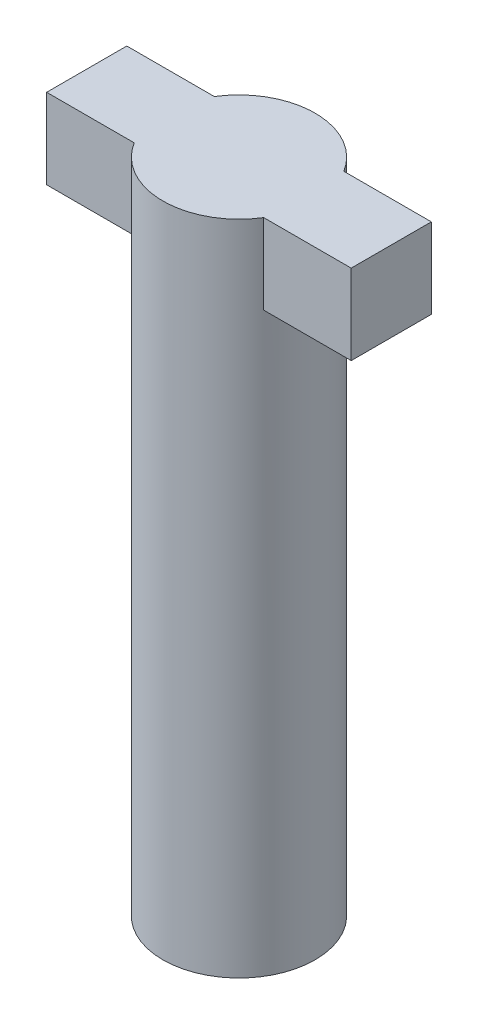
ISO-10303-21;
HEADER;
FILE_DESCRIPTION(('STEP AP214'),'2;1');
FILE_NAME('part.step','',(''),(''),'','','');
FILE_SCHEMA(('AUTOMOTIVE_DESIGN { 1 0 10303 214 1 1 1 1 }'));
ENDSEC;
DATA;
#1=APPLICATION_CONTEXT('core data for automotive mechanical design processes');
#2=APPLICATION_PROTOCOL_DEFINITION('international standard','automotive_design',2000,#1);
#3=PRODUCT_CONTEXT('',#1,'mechanical');
#4=PRODUCT('Part','Part','',(#3));
#5=PRODUCT_RELATED_PRODUCT_CATEGORY('part','',(#4));
#6=PRODUCT_DEFINITION_FORMATION('','',#4);
#7=PRODUCT_DEFINITION_CONTEXT('part definition',#1,'design');
#8=PRODUCT_DEFINITION('design','',#6,#7);
#9=PRODUCT_DEFINITION_SHAPE('','',#8);
#10=(LENGTH_UNIT() NAMED_UNIT(*) SI_UNIT(.MILLI.,.METRE.));
#11=(NAMED_UNIT(*) PLANE_ANGLE_UNIT() SI_UNIT($,.RADIAN.));
#12=(NAMED_UNIT(*) SI_UNIT($,.STERADIAN.) SOLID_ANGLE_UNIT());
#13=UNCERTAINTY_MEASURE_WITH_UNIT(LENGTH_MEASURE(1.E-05),#10,'distance_accuracy_value','');
#14=(GEOMETRIC_REPRESENTATION_CONTEXT(3) GLOBAL_UNCERTAINTY_ASSIGNED_CONTEXT((#13)) GLOBAL_UNIT_ASSIGNED_CONTEXT((#10,
#11,#12)) REPRESENTATION_CONTEXT('',''));
#15=CARTESIAN_POINT('',(0.,0.,0.));
#16=DIRECTION('',(0.,0.,1.));
#17=DIRECTION('',(1.,0.,0.));
#18=AXIS2_PLACEMENT_3D('',#15,#16,#17);
#19=CARTESIAN_POINT('',(0.,8.2,0.));
#20=DIRECTION('',(0.,-1.,0.));
#21=DIRECTION('',(0.,0.,-1.));
#22=AXIS2_PLACEMENT_3D('',#19,#20,#21);
#23=CYLINDRICAL_SURFACE('',#22,0.95);
#24=CARTESIAN_POINT('',(0.,7.2,0.));
#25=DIRECTION('',(0.,1.,0.));
#26=DIRECTION('',(0.,0.,1.));
#27=AXIS2_PLACEMENT_3D('',#24,#25,#26);
#28=CIRCLE('',#27,0.95);
#29=CARTESIAN_POINT('',(-0.807774721070176,7.2,-0.5));
#30=VERTEX_POINT('',#29);
#31=CARTESIAN_POINT('',(-0.807774721070176,7.2,0.5));
#32=VERTEX_POINT('',#31);
#33=EDGE_CURVE('E124',#30,#32,#28,.T.);
#34=ORIENTED_EDGE('',*,*,#33,.F.);
#35=DIRECTION('',(0.,1.,0.));
#36=VECTOR('',#35,1.);
#37=CARTESIAN_POINT('',(-0.807774721070176,7.2,-0.5));
#38=LINE('',#37,#36);
#39=CARTESIAN_POINT('',(-0.807774721070176,8.2,-0.5));
#40=VERTEX_POINT('',#39);
#41=EDGE_CURVE('E138',#30,#40,#38,.T.);
#42=ORIENTED_EDGE('',*,*,#41,.T.);
#43=CARTESIAN_POINT('',(0.,8.2,0.));
#44=DIRECTION('',(0.,1.,0.));
#45=DIRECTION('',(0.,0.,1.));
#46=AXIS2_PLACEMENT_3D('',#43,#44,#45);
#47=CIRCLE('',#46,0.95);
#48=CARTESIAN_POINT('',(0.807774721070176,8.2,-0.5));
#49=VERTEX_POINT('',#48);
#50=EDGE_CURVE('E11',#49,#40,#47,.T.);
#51=ORIENTED_EDGE('',*,*,#50,.F.);
#52=DIRECTION('',(0.,1.,0.));
#53=VECTOR('',#52,1.);
#54=CARTESIAN_POINT('',(0.807774721070176,7.2,-0.5));
#55=LINE('',#54,#53);
#56=CARTESIAN_POINT('',(0.807774721070176,7.2,-0.5));
#57=VERTEX_POINT('',#56);
#58=EDGE_CURVE('E176',#57,#49,#55,.T.);
#59=ORIENTED_EDGE('',*,*,#58,.F.);
#60=CARTESIAN_POINT('',(0.,7.2,0.));
#61=DIRECTION('',(0.,1.,0.));
#62=DIRECTION('',(0.,0.,1.));
#63=AXIS2_PLACEMENT_3D('',#60,#61,#62);
#64=CIRCLE('',#63,0.95);
#65=CARTESIAN_POINT('',(0.807774721070176,7.2,0.5));
#66=VERTEX_POINT('',#65);
#67=EDGE_CURVE('E165',#66,#57,#64,.T.);
#68=ORIENTED_EDGE('',*,*,#67,.F.);
#69=DIRECTION('',(0.,1.,0.));
#70=VECTOR('',#69,1.);
#71=CARTESIAN_POINT('',(0.807774721070176,7.2,0.5));
#72=LINE('',#71,#70);
#73=CARTESIAN_POINT('',(0.807774721070176,8.2,0.5));
#74=VERTEX_POINT('',#73);
#75=EDGE_CURVE('E192',#66,#74,#72,.T.);
#76=ORIENTED_EDGE('',*,*,#75,.T.);
#77=CARTESIAN_POINT('',(-0.807774721070176,8.2,0.5));
#78=VERTEX_POINT('',#77);
#79=EDGE_CURVE('E56',#78,#74,#47,.T.);
#80=ORIENTED_EDGE('',*,*,#79,.F.);
#81=DIRECTION('',(0.,1.,0.));
#82=VECTOR('',#81,1.);
#83=CARTESIAN_POINT('',(-0.807774721070176,7.2,0.5));
#84=LINE('',#83,#82);
#85=EDGE_CURVE('E156',#32,#78,#84,.T.);
#86=ORIENTED_EDGE('',*,*,#85,.F.);
#87=EDGE_LOOP('',(#34,#42,#51,#59,#68,#76,#80,#86));
#88=FACE_BOUND('',#87,.T.);
#89=CARTESIAN_POINT('',(0.,0.,0.));
#90=DIRECTION('',(0.,1.,0.));
#91=DIRECTION('',(0.,0.,1.));
#92=AXIS2_PLACEMENT_3D('',#89,#90,#91);
#93=CIRCLE('',#92,0.95);
#94=CARTESIAN_POINT('',(0.,0.,0.95));
#95=VERTEX_POINT('',#94);
#96=EDGE_CURVE('E50',#95,#95,#93,.T.);
#97=ORIENTED_EDGE('',*,*,#96,.T.);
#98=EDGE_LOOP('',(#97));
#99=FACE_BOUND('',#98,.T.);
#100=ADVANCED_FACE('F47',(#88,#99),#23,.T.);
#101=CARTESIAN_POINT('',(0.,8.2,0.));
#102=DIRECTION('',(0.,1.,0.));
#103=DIRECTION('',(0.,0.,1.));
#104=AXIS2_PLACEMENT_3D('',#101,#102,#103);
#105=PLANE('',#104);
#106=ORIENTED_EDGE('',*,*,#79,.T.);
#107=DIRECTION('',(1.,0.,0.));
#108=VECTOR('',#107,1.);
#109=CARTESIAN_POINT('',(0.,8.2,0.5));
#110=LINE('',#109,#108);
#111=CARTESIAN_POINT('',(1.9,8.2,0.5));
#112=VERTEX_POINT('',#111);
#113=EDGE_CURVE('E179',#74,#112,#110,.T.);
#114=ORIENTED_EDGE('',*,*,#113,.T.);
#115=DIRECTION('',(0.,0.,1.));
#116=VECTOR('',#115,1.);
#117=CARTESIAN_POINT('',(1.9,8.2,0.));
#118=LINE('',#117,#116);
#119=CARTESIAN_POINT('',(1.9,8.2,-0.5));
#120=VERTEX_POINT('',#119);
#121=EDGE_CURVE('E166',#120,#112,#118,.T.);
#122=ORIENTED_EDGE('',*,*,#121,.F.);
#123=DIRECTION('',(1.,0.,0.));
#124=VECTOR('',#123,1.);
#125=CARTESIAN_POINT('',(0.,8.2,-0.5));
#126=LINE('',#125,#124);
#127=EDGE_CURVE('E69',#49,#120,#126,.T.);
#128=ORIENTED_EDGE('',*,*,#127,.F.);
#129=ORIENTED_EDGE('',*,*,#50,.T.);
#130=DIRECTION('',(-1.,0.,0.));
#131=VECTOR('',#130,1.);
#132=CARTESIAN_POINT('',(0.,8.2,-0.5));
#133=LINE('',#132,#131);
#134=CARTESIAN_POINT('',(-1.9,8.2,-0.5));
#135=VERTEX_POINT('',#134);
#136=EDGE_CURVE('E148',#40,#135,#133,.T.);
#137=ORIENTED_EDGE('',*,*,#136,.T.);
#138=DIRECTION('',(0.,0.,1.));
#139=VECTOR('',#138,1.);
#140=CARTESIAN_POINT('',(-1.9,8.2,0.));
#141=LINE('',#140,#139);
#142=CARTESIAN_POINT('',(-1.9,8.2,0.5));
#143=VERTEX_POINT('',#142);
#144=EDGE_CURVE('E118',#135,#143,#141,.T.);
#145=ORIENTED_EDGE('',*,*,#144,.T.);
#146=DIRECTION('',(-1.,0.,0.));
#147=VECTOR('',#146,1.);
#148=CARTESIAN_POINT('',(0.,8.2,0.5));
#149=LINE('',#148,#147);
#150=EDGE_CURVE('E63',#78,#143,#149,.T.);
#151=ORIENTED_EDGE('',*,*,#150,.F.);
#152=EDGE_LOOP('',(#106,#114,#122,#128,#129,#137,#145,#151));
#153=FACE_BOUND('',#152,.T.);
#154=ADVANCED_FACE('F207',(#153),#105,.T.);
#155=CARTESIAN_POINT('',(0.,0.,0.));
#156=DIRECTION('',(0.,1.,0.));
#157=DIRECTION('',(0.,0.,1.));
#158=AXIS2_PLACEMENT_3D('',#155,#156,#157);
#159=PLANE('',#158);
#160=ORIENTED_EDGE('',*,*,#96,.F.);
#161=EDGE_LOOP('',(#160));
#162=FACE_BOUND('',#161,.T.);
#163=ADVANCED_FACE('F204',(#162),#159,.F.);
#164=CARTESIAN_POINT('',(0.,7.2,-0.5));
#165=DIRECTION('',(0.,0.,1.));
#166=DIRECTION('',(1.,0.,0.));
#167=AXIS2_PLACEMENT_3D('',#164,#165,#166);
#168=PLANE('',#167);
#169=ORIENTED_EDGE('',*,*,#127,.T.);
#170=DIRECTION('',(0.,1.,0.));
#171=VECTOR('',#170,1.);
#172=CARTESIAN_POINT('',(1.9,7.2,-0.5));
#173=LINE('',#172,#171);
#174=CARTESIAN_POINT('',(1.9,7.2,-0.5));
#175=VERTEX_POINT('',#174);
#176=EDGE_CURVE('E151',#175,#120,#173,.T.);
#177=ORIENTED_EDGE('',*,*,#176,.F.);
#178=DIRECTION('',(1.,0.,0.));
#179=VECTOR('',#178,1.);
#180=CARTESIAN_POINT('',(0.,7.2,-0.5));
#181=LINE('',#180,#179);
#182=EDGE_CURVE('E161',#57,#175,#181,.T.);
#183=ORIENTED_EDGE('',*,*,#182,.F.);
#184=ORIENTED_EDGE('',*,*,#58,.T.);
#185=EDGE_LOOP('',(#169,#177,#183,#184));
#186=FACE_BOUND('',#185,.T.);
#187=ADVANCED_FACE('F206',(#186),#168,.F.);
#188=CARTESIAN_POINT('',(1.9,7.2,0.));
#189=DIRECTION('',(-1.,0.,0.));
#190=DIRECTION('',(0.,0.,1.));
#191=AXIS2_PLACEMENT_3D('',#188,#189,#190);
#192=PLANE('',#191);
#193=ORIENTED_EDGE('',*,*,#121,.T.);
#194=DIRECTION('',(0.,1.,0.));
#195=VECTOR('',#194,1.);
#196=CARTESIAN_POINT('',(1.9,7.2,0.5));
#197=LINE('',#196,#195);
#198=CARTESIAN_POINT('',(1.9,7.2,0.5));
#199=VERTEX_POINT('',#198);
#200=EDGE_CURVE('E189',#199,#112,#197,.T.);
#201=ORIENTED_EDGE('',*,*,#200,.F.);
#202=DIRECTION('',(0.,0.,1.));
#203=VECTOR('',#202,1.);
#204=CARTESIAN_POINT('',(1.9,7.2,0.));
#205=LINE('',#204,#203);
#206=EDGE_CURVE('E173',#175,#199,#205,.T.);
#207=ORIENTED_EDGE('',*,*,#206,.F.);
#208=ORIENTED_EDGE('',*,*,#176,.T.);
#209=EDGE_LOOP('',(#193,#201,#207,#208));
#210=FACE_BOUND('',#209,.T.);
#211=ADVANCED_FACE('F212',(#210),#192,.F.);
#212=CARTESIAN_POINT('',(0.,7.2,0.5));
#213=DIRECTION('',(0.,0.,1.));
#214=DIRECTION('',(1.,0.,0.));
#215=AXIS2_PLACEMENT_3D('',#212,#213,#214);
#216=PLANE('',#215);
#217=ORIENTED_EDGE('',*,*,#113,.F.);
#218=ORIENTED_EDGE('',*,*,#75,.F.);
#219=DIRECTION('',(1.,0.,0.));
#220=VECTOR('',#219,1.);
#221=CARTESIAN_POINT('',(0.,7.2,0.5));
#222=LINE('',#221,#220);
#223=EDGE_CURVE('E169',#66,#199,#222,.T.);
#224=ORIENTED_EDGE('',*,*,#223,.T.);
#225=ORIENTED_EDGE('',*,*,#200,.T.);
#226=EDGE_LOOP('',(#217,#218,#224,#225));
#227=FACE_BOUND('',#226,.T.);
#228=ADVANCED_FACE('F233',(#227),#216,.T.);
#229=CARTESIAN_POINT('',(0.,7.2,0.));
#230=DIRECTION('',(0.,1.,0.));
#231=DIRECTION('',(0.,0.,1.));
#232=AXIS2_PLACEMENT_3D('',#229,#230,#231);
#233=PLANE('',#232);
#234=ORIENTED_EDGE('',*,*,#182,.T.);
#235=ORIENTED_EDGE('',*,*,#206,.T.);
#236=ORIENTED_EDGE('',*,*,#223,.F.);
#237=ORIENTED_EDGE('',*,*,#67,.T.);
#238=EDGE_LOOP('',(#234,#235,#236,#237));
#239=FACE_BOUND('',#238,.T.);
#240=ADVANCED_FACE('F229',(#239),#233,.F.);
#241=CARTESIAN_POINT('',(0.,7.2,-0.5));
#242=DIRECTION('',(0.,0.,-1.));
#243=DIRECTION('',(-1.,0.,0.));
#244=AXIS2_PLACEMENT_3D('',#241,#242,#243);
#245=PLANE('',#244);
#246=ORIENTED_EDGE('',*,*,#136,.F.);
#247=ORIENTED_EDGE('',*,*,#41,.F.);
#248=DIRECTION('',(-1.,0.,0.));
#249=VECTOR('',#248,1.);
#250=CARTESIAN_POINT('',(0.,7.2,-0.5));
#251=LINE('',#250,#249);
#252=CARTESIAN_POINT('',(-1.9,7.2,-0.5));
#253=VERTEX_POINT('',#252);
#254=EDGE_CURVE('E129',#30,#253,#251,.T.);
#255=ORIENTED_EDGE('',*,*,#254,.T.);
#256=DIRECTION('',(0.,1.,0.));
#257=VECTOR('',#256,1.);
#258=CARTESIAN_POINT('',(-1.9,7.2,-0.5));
#259=LINE('',#258,#257);
#260=EDGE_CURVE('E114',#253,#135,#259,.T.);
#261=ORIENTED_EDGE('',*,*,#260,.T.);
#262=EDGE_LOOP('',(#246,#247,#255,#261));
#263=FACE_BOUND('',#262,.T.);
#264=ADVANCED_FACE('F136',(#263),#245,.T.);
#265=CARTESIAN_POINT('',(0.,7.2,0.5));
#266=DIRECTION('',(0.,0.,-1.));
#267=DIRECTION('',(-1.,0.,0.));
#268=AXIS2_PLACEMENT_3D('',#265,#266,#267);
#269=PLANE('',#268);
#270=ORIENTED_EDGE('',*,*,#150,.T.);
#271=DIRECTION('',(0.,1.,0.));
#272=VECTOR('',#271,1.);
#273=CARTESIAN_POINT('',(-1.9,7.2,0.5));
#274=LINE('',#273,#272);
#275=CARTESIAN_POINT('',(-1.9,7.2,0.5));
#276=VERTEX_POINT('',#275);
#277=EDGE_CURVE('E123',#276,#143,#274,.T.);
#278=ORIENTED_EDGE('',*,*,#277,.F.);
#279=DIRECTION('',(-1.,0.,0.));
#280=VECTOR('',#279,1.);
#281=CARTESIAN_POINT('',(0.,7.2,0.5));
#282=LINE('',#281,#280);
#283=EDGE_CURVE('E132',#32,#276,#282,.T.);
#284=ORIENTED_EDGE('',*,*,#283,.F.);
#285=ORIENTED_EDGE('',*,*,#85,.T.);
#286=EDGE_LOOP('',(#270,#278,#284,#285));
#287=FACE_BOUND('',#286,.T.);
#288=ADVANCED_FACE('F223',(#287),#269,.F.);
#289=CARTESIAN_POINT('',(-1.9,7.2,0.));
#290=DIRECTION('',(-1.,0.,0.));
#291=DIRECTION('',(0.,0.,1.));
#292=AXIS2_PLACEMENT_3D('',#289,#290,#291);
#293=PLANE('',#292);
#294=ORIENTED_EDGE('',*,*,#144,.F.);
#295=ORIENTED_EDGE('',*,*,#260,.F.);
#296=DIRECTION('',(0.,0.,1.));
#297=VECTOR('',#296,1.);
#298=CARTESIAN_POINT('',(-1.9,7.2,0.));
#299=LINE('',#298,#297);
#300=EDGE_CURVE('E117',#253,#276,#299,.T.);
#301=ORIENTED_EDGE('',*,*,#300,.T.);
#302=ORIENTED_EDGE('',*,*,#277,.T.);
#303=EDGE_LOOP('',(#294,#295,#301,#302));
#304=FACE_BOUND('',#303,.T.);
#305=ADVANCED_FACE('F116',(#304),#293,.T.);
#306=CARTESIAN_POINT('',(0.,7.2,0.));
#307=DIRECTION('',(0.,1.,0.));
#308=DIRECTION('',(0.,0.,1.));
#309=AXIS2_PLACEMENT_3D('',#306,#307,#308);
#310=PLANE('',#309);
#311=ORIENTED_EDGE('',*,*,#254,.F.);
#312=ORIENTED_EDGE('',*,*,#33,.T.);
#313=ORIENTED_EDGE('',*,*,#283,.T.);
#314=ORIENTED_EDGE('',*,*,#300,.F.);
#315=EDGE_LOOP('',(#311,#312,#313,#314));
#316=FACE_BOUND('',#315,.T.);
#317=ADVANCED_FACE('F128',(#316),#310,.F.);
#318=CLOSED_SHELL('',(#100,#154,#163,#187,#211,#228,#240,#264,#288,#305,#317));
#319=MANIFOLD_SOLID_BREP('B2',#318);
#320=ADVANCED_BREP_SHAPE_REPRESENTATION('',(#18,#319),#14);
#321=SHAPE_DEFINITION_REPRESENTATION(#9,#320);
ENDSEC;
END-ISO-10303-21;
